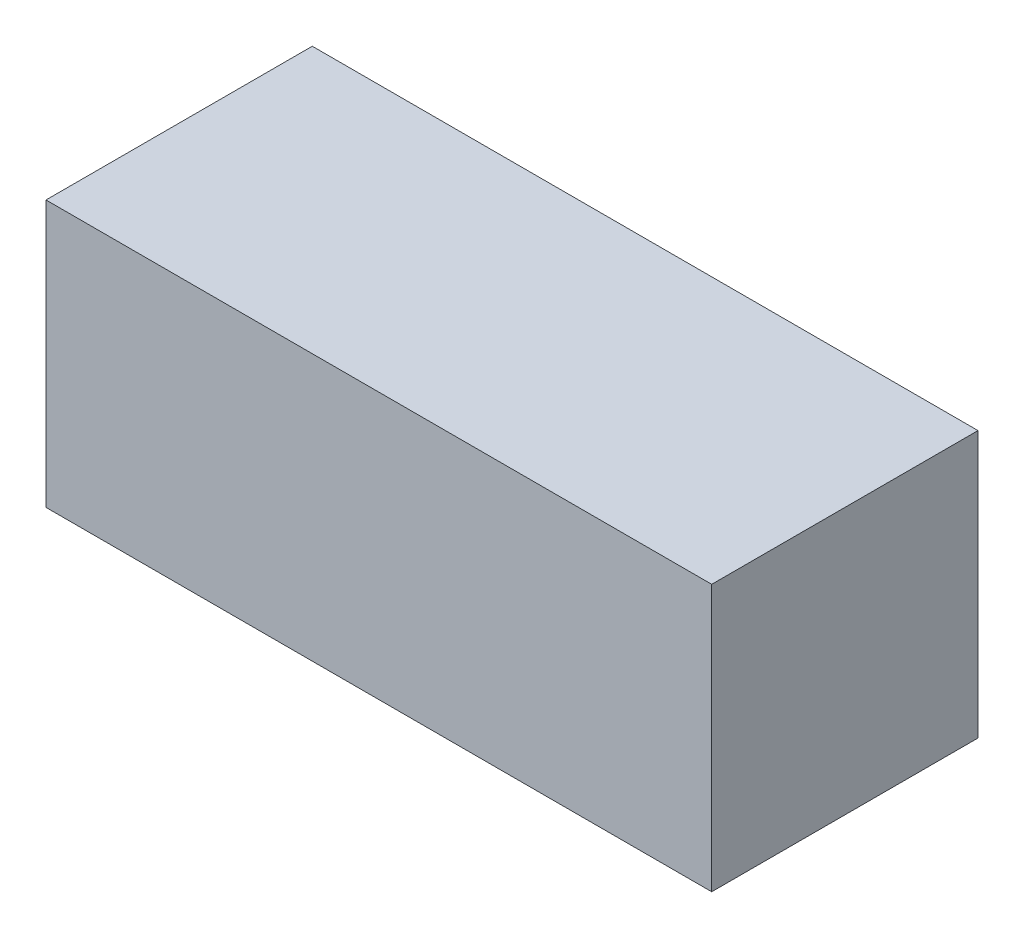
ISO-10303-21;
HEADER;
FILE_DESCRIPTION(('STEP AP214'),'2;1');
FILE_NAME('part.step','',(''),(''),'','','');
FILE_SCHEMA(('AUTOMOTIVE_DESIGN { 1 0 10303 214 1 1 1 1 }'));
ENDSEC;
DATA;
#1=APPLICATION_CONTEXT('core data for automotive mechanical design processes');
#2=APPLICATION_PROTOCOL_DEFINITION('international standard','automotive_design',2000,#1);
#3=PRODUCT_CONTEXT('',#1,'mechanical');
#4=PRODUCT('Part','Part','',(#3));
#5=PRODUCT_RELATED_PRODUCT_CATEGORY('part','',(#4));
#6=PRODUCT_DEFINITION_FORMATION('','',#4);
#7=PRODUCT_DEFINITION_CONTEXT('part definition',#1,'design');
#8=PRODUCT_DEFINITION('design','',#6,#7);
#9=PRODUCT_DEFINITION_SHAPE('','',#8);
#10=(LENGTH_UNIT() NAMED_UNIT(*) SI_UNIT(.MILLI.,.METRE.));
#11=(NAMED_UNIT(*) PLANE_ANGLE_UNIT() SI_UNIT($,.RADIAN.));
#12=(NAMED_UNIT(*) SI_UNIT($,.STERADIAN.) SOLID_ANGLE_UNIT());
#13=UNCERTAINTY_MEASURE_WITH_UNIT(LENGTH_MEASURE(1.E-05),#10,'distance_accuracy_value','');
#14=(GEOMETRIC_REPRESENTATION_CONTEXT(3) GLOBAL_UNCERTAINTY_ASSIGNED_CONTEXT((#13)) GLOBAL_UNIT_ASSIGNED_CONTEXT((#10,
#11,#12)) REPRESENTATION_CONTEXT('',''));
#15=CARTESIAN_POINT('',(0.,0.,0.));
#16=DIRECTION('',(0.,0.,1.));
#17=DIRECTION('',(1.,0.,0.));
#18=AXIS2_PLACEMENT_3D('',#15,#16,#17);
#19=CARTESIAN_POINT('',(503.178608832802,2000.,197.681641947689));
#20=DIRECTION('',(-1.,0.,0.));
#21=DIRECTION('',(0.,0.,1.));
#22=AXIS2_PLACEMENT_3D('',#19,#20,#21);
#23=PLANE('',#22);
#24=DIRECTION('',(0.,0.,-1.));
#25=VECTOR('',#24,1.);
#26=CARTESIAN_POINT('',(503.178608832802,0.,197.681641947689));
#27=LINE('',#26,#25);
#28=CARTESIAN_POINT('',(503.178608832802,0.,2197.68164194769));
#29=VERTEX_POINT('',#28);
#30=CARTESIAN_POINT('',(503.178608832802,0.,197.681641947689));
#31=VERTEX_POINT('',#30);
#32=EDGE_CURVE('E1816',#29,#31,#27,.T.);
#33=ORIENTED_EDGE('',*,*,#32,.T.);
#34=DIRECTION('',(0.,-1.,0.));
#35=VECTOR('',#34,1.);
#36=CARTESIAN_POINT('',(503.178608832802,2000.,197.681641947689));
#37=LINE('',#36,#35);
#38=CARTESIAN_POINT('',(503.178608832802,2000.,197.681641947689));
#39=VERTEX_POINT('',#38);
#40=EDGE_CURVE('E13',#39,#31,#37,.T.);
#41=ORIENTED_EDGE('',*,*,#40,.F.);
#42=DIRECTION('',(0.,0.,-1.));
#43=VECTOR('',#42,1.);
#44=CARTESIAN_POINT('',(503.178608832802,2000.,197.681641947689));
#45=LINE('',#44,#43);
#46=CARTESIAN_POINT('',(503.178608832802,2000.,2197.68164194769));
#47=VERTEX_POINT('',#46);
#48=EDGE_CURVE('E1804',#47,#39,#45,.T.);
#49=ORIENTED_EDGE('',*,*,#48,.F.);
#50=DIRECTION('',(0.,-1.,0.));
#51=VECTOR('',#50,1.);
#52=CARTESIAN_POINT('',(503.178608832802,2000.,2197.68164194769));
#53=LINE('',#52,#51);
#54=EDGE_CURVE('E1812',#47,#29,#53,.T.);
#55=ORIENTED_EDGE('',*,*,#54,.T.);
#56=EDGE_LOOP('',(#33,#41,#49,#55));
#57=FACE_BOUND('',#56,.T.);
#58=ADVANCED_FACE('F1753',(#57),#23,.F.);
#59=CARTESIAN_POINT('',(503.178608832802,2000.,197.681641947689));
#60=DIRECTION('',(0.,0.,1.));
#61=DIRECTION('',(1.,0.,0.));
#62=AXIS2_PLACEMENT_3D('',#59,#60,#61);
#63=PLANE('',#62);
#64=DIRECTION('',(-1.,0.,0.));
#65=VECTOR('',#64,1.);
#66=CARTESIAN_POINT('',(503.178608832802,0.,197.681641947689));
#67=LINE('',#66,#65);
#68=CARTESIAN_POINT('',(-4496.8213911672,0.,197.681641947689));
#69=VERTEX_POINT('',#68);
#70=EDGE_CURVE('E1808',#31,#69,#67,.T.);
#71=ORIENTED_EDGE('',*,*,#70,.T.);
#72=DIRECTION('',(0.,-1.,0.));
#73=VECTOR('',#72,1.);
#74=CARTESIAN_POINT('',(-4496.8213911672,2000.,197.681641947689));
#75=LINE('',#74,#73);
#76=CARTESIAN_POINT('',(-4496.8213911672,2000.,197.681641947689));
#77=VERTEX_POINT('',#76);
#78=EDGE_CURVE('E1761',#77,#69,#75,.T.);
#79=ORIENTED_EDGE('',*,*,#78,.F.);
#80=DIRECTION('',(-1.,0.,0.));
#81=VECTOR('',#80,1.);
#82=CARTESIAN_POINT('',(503.178608832802,2000.,197.681641947689));
#83=LINE('',#82,#81);
#84=EDGE_CURVE('E1799',#39,#77,#83,.T.);
#85=ORIENTED_EDGE('',*,*,#84,.F.);
#86=ORIENTED_EDGE('',*,*,#40,.T.);
#87=EDGE_LOOP('',(#71,#79,#85,#86));
#88=FACE_BOUND('',#87,.T.);
#89=ADVANCED_FACE('F1807',(#88),#63,.F.);
#90=CARTESIAN_POINT('',(-4496.8213911672,2000.,197.681641947689));
#91=DIRECTION('',(1.,0.,0.));
#92=DIRECTION('',(0.,0.,-1.));
#93=AXIS2_PLACEMENT_3D('',#90,#91,#92);
#94=PLANE('',#93);
#95=DIRECTION('',(0.,0.,1.));
#96=VECTOR('',#95,1.);
#97=CARTESIAN_POINT('',(-4496.8213911672,0.,197.681641947689));
#98=LINE('',#97,#96);
#99=CARTESIAN_POINT('',(-4496.8213911672,0.,2197.68164194769));
#100=VERTEX_POINT('',#99);
#101=EDGE_CURVE('E1786',#69,#100,#98,.T.);
#102=ORIENTED_EDGE('',*,*,#101,.T.);
#103=DIRECTION('',(0.,-1.,0.));
#104=VECTOR('',#103,1.);
#105=CARTESIAN_POINT('',(-4496.8213911672,2000.,2197.68164194769));
#106=LINE('',#105,#104);
#107=CARTESIAN_POINT('',(-4496.8213911672,2000.,2197.68164194769));
#108=VERTEX_POINT('',#107);
#109=EDGE_CURVE('E1809',#108,#100,#106,.T.);
#110=ORIENTED_EDGE('',*,*,#109,.F.);
#111=DIRECTION('',(0.,0.,1.));
#112=VECTOR('',#111,1.);
#113=CARTESIAN_POINT('',(-4496.8213911672,2000.,197.681641947689));
#114=LINE('',#113,#112);
#115=EDGE_CURVE('E1802',#77,#108,#114,.T.);
#116=ORIENTED_EDGE('',*,*,#115,.F.);
#117=ORIENTED_EDGE('',*,*,#78,.T.);
#118=EDGE_LOOP('',(#102,#110,#116,#117));
#119=FACE_BOUND('',#118,.T.);
#120=ADVANCED_FACE('F1810',(#119),#94,.F.);
#121=CARTESIAN_POINT('',(503.178608832802,2000.,2197.68164194769));
#122=DIRECTION('',(0.,0.,-1.));
#123=DIRECTION('',(-1.,0.,0.));
#124=AXIS2_PLACEMENT_3D('',#121,#122,#123);
#125=PLANE('',#124);
#126=DIRECTION('',(1.,0.,0.));
#127=VECTOR('',#126,1.);
#128=CARTESIAN_POINT('',(503.178608832802,0.,2197.68164194769));
#129=LINE('',#128,#127);
#130=EDGE_CURVE('E1792',#100,#29,#129,.T.);
#131=ORIENTED_EDGE('',*,*,#130,.T.);
#132=ORIENTED_EDGE('',*,*,#54,.F.);
#133=DIRECTION('',(1.,0.,0.));
#134=VECTOR('',#133,1.);
#135=CARTESIAN_POINT('',(503.178608832802,2000.,2197.68164194769));
#136=LINE('',#135,#134);
#137=EDGE_CURVE('E1769',#108,#47,#136,.T.);
#138=ORIENTED_EDGE('',*,*,#137,.F.);
#139=ORIENTED_EDGE('',*,*,#109,.T.);
#140=EDGE_LOOP('',(#131,#132,#138,#139));
#141=FACE_BOUND('',#140,.T.);
#142=ADVANCED_FACE('F1823',(#141),#125,.F.);
#143=CARTESIAN_POINT('',(0.,2000.,0.));
#144=DIRECTION('',(0.,-1.,0.));
#145=DIRECTION('',(0.,0.,-1.));
#146=AXIS2_PLACEMENT_3D('',#143,#144,#145);
#147=PLANE('',#146);
#148=ORIENTED_EDGE('',*,*,#48,.T.);
#149=ORIENTED_EDGE('',*,*,#84,.T.);
#150=ORIENTED_EDGE('',*,*,#115,.T.);
#151=ORIENTED_EDGE('',*,*,#137,.T.);
#152=EDGE_LOOP('',(#148,#149,#150,#151));
#153=FACE_BOUND('',#152,.T.);
#154=ADVANCED_FACE('F1800',(#153),#147,.F.);
#155=CARTESIAN_POINT('',(0.,0.,0.));
#156=DIRECTION('',(0.,-1.,0.));
#157=DIRECTION('',(0.,0.,-1.));
#158=AXIS2_PLACEMENT_3D('',#155,#156,#157);
#159=PLANE('',#158);
#160=ORIENTED_EDGE('',*,*,#32,.F.);
#161=ORIENTED_EDGE('',*,*,#130,.F.);
#162=ORIENTED_EDGE('',*,*,#101,.F.);
#163=ORIENTED_EDGE('',*,*,#70,.F.);
#164=EDGE_LOOP('',(#160,#161,#162,#163));
#165=FACE_BOUND('',#164,.T.);
#166=ADVANCED_FACE('F1826',(#165),#159,.T.);
#167=CLOSED_SHELL('',(#58,#89,#120,#142,#154,#166));
#168=MANIFOLD_SOLID_BREP('B2_NOT_SHOWN',#167);
#169=CARTESIAN_POINT('',(-258.447090393941,705.,341.76577979491));
#170=DIRECTION('',(0.,1.,0.));
#171=DIRECTION('',(0.,0.,1.));
#172=AXIS2_PLACEMENT_3D('',#169,#170,#171);
#173=PLANE('',#172);
#174=CARTESIAN_POINT('',(-474.449169572246,705.,382.793687092254));
#175=DIRECTION('',(0.,1.,0.));
#176=DIRECTION('',(0.,0.,1.));
#177=AXIS2_PLACEMENT_3D('',#174,#175,#176);
#178=CIRCLE('',#177,3.02232510648865);
#179=CARTESIAN_POINT('',(-474.449169572246,705.,385.816012198742));
#180=VERTEX_POINT('',#179);
#181=EDGE_CURVE('E2245',#180,#180,#178,.T.);
#182=ORIENTED_EDGE('',*,*,#181,.F.);
#183=EDGE_LOOP('',(#182));
#184=FACE_BOUND('',#183,.T.);
#185=CARTESIAN_POINT('',(-466.317801150332,705.,375.92365410933));
#186=DIRECTION('',(0.,1.,0.));
#187=DIRECTION('',(0.,0.,1.));
#188=AXIS2_PLACEMENT_3D('',#185,#186,#187);
#189=CIRCLE('',#188,2.92635446588858);
#190=CARTESIAN_POINT('',(-466.317801150332,705.,378.850008575219));
#191=VERTEX_POINT('',#190);
#192=EDGE_CURVE('E2574',#191,#191,#189,.T.);
#193=ORIENTED_EDGE('',*,*,#192,.F.);
#194=EDGE_LOOP('',(#193));
#195=FACE_BOUND('',#194,.T.);
#196=CARTESIAN_POINT('',(-431.013382426237,705.,332.77130718692));
#197=DIRECTION('',(0.,1.,0.));
#198=DIRECTION('',(0.,0.,1.));
#199=AXIS2_PLACEMENT_3D('',#196,#197,#198);
#200=CIRCLE('',#199,2.96969460121312);
#201=CARTESIAN_POINT('',(-431.013382426237,705.,335.741001788134));
#202=VERTEX_POINT('',#201);
#203=EDGE_CURVE('E2577',#202,#202,#200,.T.);
#204=ORIENTED_EDGE('',*,*,#203,.F.);
#205=EDGE_LOOP('',(#204));
#206=FACE_BOUND('',#205,.T.);
#207=CARTESIAN_POINT('',(-421.082774625095,705.,327.80979347949));
#208=DIRECTION('',(0.,1.,0.));
#209=DIRECTION('',(0.,0.,1.));
#210=AXIS2_PLACEMENT_3D('',#207,#208,#209);
#211=CIRCLE('',#210,3.01217780293913);
#212=CARTESIAN_POINT('',(-421.082774625095,705.,330.821971282429));
#213=VERTEX_POINT('',#212);
#214=EDGE_CURVE('E2582',#213,#213,#211,.T.);
#215=ORIENTED_EDGE('',*,*,#214,.F.);
#216=EDGE_LOOP('',(#215));
#217=FACE_BOUND('',#216,.T.);
#218=CARTESIAN_POINT('',(-364.017672886245,705.,296.048587357132));
#219=DIRECTION('',(0.,1.,0.));
#220=DIRECTION('',(0.,0.,1.));
#221=AXIS2_PLACEMENT_3D('',#218,#219,#220);
#222=CIRCLE('',#221,3.02057651298697);
#223=CARTESIAN_POINT('',(-364.017672886245,705.,299.069163870119));
#224=VERTEX_POINT('',#223);
#225=EDGE_CURVE('E2585',#224,#224,#222,.T.);
#226=ORIENTED_EDGE('',*,*,#225,.F.);
#227=EDGE_LOOP('',(#226));
#228=FACE_BOUND('',#227,.T.);
#229=CARTESIAN_POINT('',(-346.372819063942,705.,293.429327819401));
#230=DIRECTION('',(0.,1.,0.));
#231=DIRECTION('',(0.,0.,1.));
#232=AXIS2_PLACEMENT_3D('',#229,#230,#231);
#233=CIRCLE('',#232,2.94464183129883);
#234=CARTESIAN_POINT('',(-346.372819063942,705.,296.3739696507));
#235=VERTEX_POINT('',#234);
#236=EDGE_CURVE('E2588',#235,#235,#233,.T.);
#237=ORIENTED_EDGE('',*,*,#236,.F.);
#238=EDGE_LOOP('',(#237));
#239=FACE_BOUND('',#238,.T.);
#240=CARTESIAN_POINT('',(-223.024834580686,705.,263.802212935845));
#241=DIRECTION('',(0.,1.,0.));
#242=DIRECTION('',(0.,0.,1.));
#243=AXIS2_PLACEMENT_3D('',#240,#241,#242);
#244=CIRCLE('',#243,3.99999999999999);
#245=CARTESIAN_POINT('',(-223.024834580686,705.,267.802212935845));
#246=VERTEX_POINT('',#245);
#247=EDGE_CURVE('E2591',#246,#246,#244,.T.);
#248=ORIENTED_EDGE('',*,*,#247,.F.);
#249=EDGE_LOOP('',(#248));
#250=FACE_BOUND('',#249,.T.);
#251=CARTESIAN_POINT('',(-154.344703344319,705.,260.643821632466));
#252=DIRECTION('',(0.,1.,0.));
#253=DIRECTION('',(0.,0.,1.));
#254=AXIS2_PLACEMENT_3D('',#251,#252,#253);
#255=CIRCLE('',#254,3.99999999999999);
#256=CARTESIAN_POINT('',(-154.344703344319,705.,264.643821632466));
#257=VERTEX_POINT('',#256);
#258=EDGE_CURVE('E2593',#257,#257,#255,.T.);
#259=ORIENTED_EDGE('',*,*,#258,.F.);
#260=EDGE_LOOP('',(#259));
#261=FACE_BOUND('',#260,.T.);
#262=CARTESIAN_POINT('',(-94.9095215443751,705.,263.802212935845));
#263=DIRECTION('',(0.,1.,0.));
#264=DIRECTION('',(0.,0.,1.));
#265=AXIS2_PLACEMENT_3D('',#262,#263,#264);
#266=CIRCLE('',#265,4.00000000000001);
#267=CARTESIAN_POINT('',(-94.9095215443751,705.,267.802212935845));
#268=VERTEX_POINT('',#267);
#269=EDGE_CURVE('E2048',#268,#268,#266,.T.);
#270=ORIENTED_EDGE('',*,*,#269,.F.);
#271=EDGE_LOOP('',(#270));
#272=FACE_BOUND('',#271,.T.);
#273=CARTESIAN_POINT('',(-66.2029870226294,705.,312.681641947689));
#274=CARTESIAN_POINT('',(-268.546265084858,705.,303.965113500045));
#275=CARTESIAN_POINT('',(-436.202987022629,705.,427.681641947689));
#276=B_SPLINE_CURVE_WITH_KNOTS('',2,(#273,#274,#275),.UNSPECIFIED.,.F.,.F.,(3,3),(0.,1.),.UNSPECIFIED.);
#277=CARTESIAN_POINT('',(-66.2029870226294,705.,312.681641947689));
#278=VERTEX_POINT('',#277);
#279=CARTESIAN_POINT('',(-436.202987022629,705.,427.681641947689));
#280=VERTEX_POINT('',#279);
#281=EDGE_CURVE('E1901',#278,#280,#276,.T.);
#282=ORIENTED_EDGE('',*,*,#281,.F.);
#283=DIRECTION('',(0.,0.,-1.));
#284=VECTOR('',#283,1.);
#285=CARTESIAN_POINT('',(-66.2029870226294,705.,317.681641947689));
#286=LINE('',#285,#284);
#287=CARTESIAN_POINT('',(-66.2029870226294,705.,317.681641947689));
#288=VERTEX_POINT('',#287);
#289=EDGE_CURVE('E2216',#288,#278,#286,.T.);
#290=ORIENTED_EDGE('',*,*,#289,.F.);
#291=CARTESIAN_POINT('',(-66.2029870226294,705.,277.681641947689));
#292=DIRECTION('',(0.,1.,0.));
#293=DIRECTION('',(0.,0.,1.));
#294=AXIS2_PLACEMENT_3D('',#291,#292,#293);
#295=CIRCLE('',#294,40.);
#296=CARTESIAN_POINT('',(-26.2029870226294,705.,277.681641947689));
#297=VERTEX_POINT('',#296);
#298=EDGE_CURVE('E2167',#288,#297,#295,.T.);
#299=ORIENTED_EDGE('',*,*,#298,.T.);
#300=DIRECTION('',(0.,0.,-1.));
#301=VECTOR('',#300,1.);
#302=CARTESIAN_POINT('',(-26.2029870226295,705.,237.681641947689));
#303=LINE('',#302,#301);
#304=CARTESIAN_POINT('',(-26.2029870226295,705.,242.681641947689));
#305=VERTEX_POINT('',#304);
#306=EDGE_CURVE('E2160',#297,#305,#303,.T.);
#307=ORIENTED_EDGE('',*,*,#306,.T.);
#308=DIRECTION('',(1.,0.,0.));
#309=VECTOR('',#308,1.);
#310=CARTESIAN_POINT('',(-563.923005749217,705.,242.681641947689));
#311=LINE('',#310,#309);
#312=CARTESIAN_POINT('',(-516.202987022629,705.,242.681641947689));
#313=VERTEX_POINT('',#312);
#314=EDGE_CURVE('E2290',#313,#305,#311,.T.);
#315=ORIENTED_EDGE('',*,*,#314,.F.);
#316=DIRECTION('',(0.,0.,1.));
#317=VECTOR('',#316,1.);
#318=CARTESIAN_POINT('',(-516.202987022629,705.,341.76577979491));
#319=LINE('',#318,#317);
#320=CARTESIAN_POINT('',(-516.202987022629,705.,432.681641947689));
#321=VERTEX_POINT('',#320);
#322=EDGE_CURVE('E2267',#313,#321,#319,.T.);
#323=ORIENTED_EDGE('',*,*,#322,.T.);
#324=DIRECTION('',(1.,0.,0.));
#325=VECTOR('',#324,1.);
#326=CARTESIAN_POINT('',(-521.202987022629,705.,432.681641947689));
#327=LINE('',#326,#325);
#328=CARTESIAN_POINT('',(-436.202987022629,705.,432.681641947689));
#329=VERTEX_POINT('',#328);
#330=EDGE_CURVE('E2184',#321,#329,#327,.T.);
#331=ORIENTED_EDGE('',*,*,#330,.T.);
#332=DIRECTION('',(0.,0.,1.));
#333=VECTOR('',#332,1.);
#334=CARTESIAN_POINT('',(-436.202987022629,705.,432.681641947689));
#335=LINE('',#334,#333);
#336=EDGE_CURVE('E1906',#280,#329,#335,.T.);
#337=ORIENTED_EDGE('',*,*,#336,.F.);
#338=EDGE_LOOP('',(#282,#290,#299,#307,#315,#323,#331,#337));
#339=FACE_BOUND('',#338,.T.);
#340=ADVANCED_FACE('F1884',(#184,#195,#206,#217,#228,#239,#250,#261,#272,#339),#173,.T.);
#341=CARTESIAN_POINT('',(-563.923005749217,0.,242.681641947689));
#342=DIRECTION('',(0.,0.,-1.));
#343=DIRECTION('',(-1.,0.,0.));
#344=AXIS2_PLACEMENT_3D('',#341,#342,#343);
#345=PLANE('',#344);
#346=DIRECTION('',(0.,1.,0.));
#347=VECTOR('',#346,1.);
#348=CARTESIAN_POINT('',(-516.202987022629,0.,242.681641947689));
#349=LINE('',#348,#347);
#350=CARTESIAN_POINT('',(-516.202987022629,715.857864376269,242.681641947689));
#351=VERTEX_POINT('',#350);
#352=EDGE_CURVE('E2265',#313,#351,#349,.T.);
#353=ORIENTED_EDGE('',*,*,#352,.F.);
#354=ORIENTED_EDGE('',*,*,#314,.T.);
#355=DIRECTION('',(0.,1.,0.));
#356=VECTOR('',#355,1.);
#357=CARTESIAN_POINT('',(-26.2029870226295,0.,242.681641947689));
#358=LINE('',#357,#356);
#359=CARTESIAN_POINT('',(-26.2029870226295,715.857864376269,242.681641947689));
#360=VERTEX_POINT('',#359);
#361=EDGE_CURVE('E2285',#305,#360,#358,.T.);
#362=ORIENTED_EDGE('',*,*,#361,.T.);
#363=DIRECTION('',(1.,0.,0.));
#364=VECTOR('',#363,1.);
#365=CARTESIAN_POINT('',(-563.923005749217,715.857864376269,242.681641947689));
#366=LINE('',#365,#364);
#367=EDGE_CURVE('E2292',#351,#360,#366,.T.);
#368=ORIENTED_EDGE('',*,*,#367,.F.);
#369=EDGE_LOOP('',(#353,#354,#362,#368));
#370=FACE_BOUND('',#369,.T.);
#371=ADVANCED_FACE('F2112',(#370),#345,.F.);
#372=CARTESIAN_POINT('',(-563.923005749217,730.,237.681641947689));
#373=DIRECTION('',(1.,0.,0.));
#374=DIRECTION('',(0.,0.,-1.));
#375=AXIS2_PLACEMENT_3D('',#372,#373,#374);
#376=CYLINDRICAL_SURFACE('',#375,15.);
#377=DIRECTION('',(1.,0.,0.));
#378=VECTOR('',#377,1.);
#379=CARTESIAN_POINT('',(-563.923005749217,745.,237.681641947689));
#380=LINE('',#379,#378);
#381=CARTESIAN_POINT('',(-516.202987022629,745.,237.681641947689));
#382=VERTEX_POINT('',#381);
#383=CARTESIAN_POINT('',(-26.2029870226295,745.,237.681641947689));
#384=VERTEX_POINT('',#383);
#385=EDGE_CURVE('E2296',#382,#384,#380,.T.);
#386=ORIENTED_EDGE('',*,*,#385,.F.);
#387=CARTESIAN_POINT('',(-516.202987022629,730.,237.681641947689));
#388=DIRECTION('',(-1.,0.,0.));
#389=DIRECTION('',(0.,0.,1.));
#390=AXIS2_PLACEMENT_3D('',#387,#388,#389);
#391=CIRCLE('',#390,15.);
#392=EDGE_CURVE('E2262',#382,#351,#391,.F.);
#393=ORIENTED_EDGE('',*,*,#392,.T.);
#394=ORIENTED_EDGE('',*,*,#367,.T.);
#395=CARTESIAN_POINT('',(-26.2029870226295,730.,237.681641947689));
#396=DIRECTION('',(1.,0.,0.));
#397=DIRECTION('',(0.,0.,-1.));
#398=AXIS2_PLACEMENT_3D('',#395,#396,#397);
#399=CIRCLE('',#398,15.);
#400=EDGE_CURVE('E2282',#384,#360,#399,.T.);
#401=ORIENTED_EDGE('',*,*,#400,.F.);
#402=EDGE_LOOP('',(#386,#393,#394,#401));
#403=FACE_BOUND('',#402,.T.);
#404=ADVANCED_FACE('F2120',(#403),#376,.T.);
#405=CARTESIAN_POINT('',(-26.2029870226295,705.,237.681641947689));
#406=DIRECTION('',(0.,0.,1.));
#407=DIRECTION('',(1.,0.,0.));
#408=AXIS2_PLACEMENT_3D('',#405,#406,#407);
#409=PLANE('',#408);
#410=DIRECTION('',(1.,0.,0.));
#411=VECTOR('',#410,1.);
#412=CARTESIAN_POINT('',(-563.923005749217,717.5,237.681641947689));
#413=LINE('',#412,#411);
#414=CARTESIAN_POINT('',(-521.202987022629,717.5,237.681641947689));
#415=VERTEX_POINT('',#414);
#416=CARTESIAN_POINT('',(-26.2029870226295,717.5,237.681641947689));
#417=VERTEX_POINT('',#416);
#418=EDGE_CURVE('E2276',#415,#417,#413,.T.);
#419=ORIENTED_EDGE('',*,*,#418,.T.);
#420=DIRECTION('',(0.,-1.,0.));
#421=VECTOR('',#420,1.);
#422=CARTESIAN_POINT('',(-26.2029870226295,705.,237.681641947689));
#423=LINE('',#422,#421);
#424=CARTESIAN_POINT('',(-26.2029870226295,700.,237.681641947689));
#425=VERTEX_POINT('',#424);
#426=EDGE_CURVE('E2189',#417,#425,#423,.T.);
#427=ORIENTED_EDGE('',*,*,#426,.T.);
#428=DIRECTION('',(-1.,0.,0.));
#429=VECTOR('',#428,1.);
#430=CARTESIAN_POINT('',(-26.2029870226295,700.,237.681641947689));
#431=LINE('',#430,#429);
#432=CARTESIAN_POINT('',(-521.202987022629,700.,237.681641947689));
#433=VERTEX_POINT('',#432);
#434=EDGE_CURVE('E2270',#425,#433,#431,.T.);
#435=ORIENTED_EDGE('',*,*,#434,.T.);
#436=DIRECTION('',(0.,-1.,0.));
#437=VECTOR('',#436,1.);
#438=CARTESIAN_POINT('',(-521.202987022629,705.,237.681641947689));
#439=LINE('',#438,#437);
#440=EDGE_CURVE('E2186',#415,#433,#439,.T.);
#441=ORIENTED_EDGE('',*,*,#440,.F.);
#442=EDGE_LOOP('',(#419,#427,#435,#441));
#443=FACE_BOUND('',#442,.T.);
#444=ADVANCED_FACE('F2138',(#443),#409,.F.);
#445=CARTESIAN_POINT('',(-521.202987022629,705.,432.681641947689));
#446=DIRECTION('',(0.,0.,-1.));
#447=DIRECTION('',(-1.,0.,0.));
#448=AXIS2_PLACEMENT_3D('',#445,#446,#447);
#449=PLANE('',#448);
#450=DIRECTION('',(1.,0.,0.));
#451=VECTOR('',#450,1.);
#452=CARTESIAN_POINT('',(-521.202987022629,700.,432.681641947689));
#453=LINE('',#452,#451);
#454=CARTESIAN_POINT('',(-521.202987022629,700.,432.681641947689));
#455=VERTEX_POINT('',#454);
#456=CARTESIAN_POINT('',(-436.202987022629,700.,432.681641947689));
#457=VERTEX_POINT('',#456);
#458=EDGE_CURVE('E2168',#455,#457,#453,.T.);
#459=ORIENTED_EDGE('',*,*,#458,.T.);
#460=DIRECTION('',(0.,-1.,0.));
#461=VECTOR('',#460,1.);
#462=CARTESIAN_POINT('',(-436.202987022629,705.,432.681641947689));
#463=LINE('',#462,#461);
#464=EDGE_CURVE('E1751',#329,#457,#463,.T.);
#465=ORIENTED_EDGE('',*,*,#464,.F.);
#466=ORIENTED_EDGE('',*,*,#330,.F.);
#467=DIRECTION('',(0.,1.,0.));
#468=VECTOR('',#467,1.);
#469=CARTESIAN_POINT('',(-516.202987022629,745.,432.681641947689));
#470=LINE('',#469,#468);
#471=CARTESIAN_POINT('',(-516.202987022629,745.,432.681641947689));
#472=VERTEX_POINT('',#471);
#473=EDGE_CURVE('E2017',#321,#472,#470,.T.);
#474=ORIENTED_EDGE('',*,*,#473,.T.);
#475=DIRECTION('',(-1.,0.,0.));
#476=VECTOR('',#475,1.);
#477=CARTESIAN_POINT('',(-516.202987022629,745.,432.681641947689));
#478=LINE('',#477,#476);
#479=CARTESIAN_POINT('',(-521.202987022629,745.,432.681641947689));
#480=VERTEX_POINT('',#479);
#481=EDGE_CURVE('E2258',#472,#480,#478,.T.);
#482=ORIENTED_EDGE('',*,*,#481,.T.);
#483=DIRECTION('',(0.,-1.,0.));
#484=VECTOR('',#483,1.);
#485=CARTESIAN_POINT('',(-521.202987022629,705.,432.681641947689));
#486=LINE('',#485,#484);
#487=EDGE_CURVE('E2166',#480,#455,#486,.T.);
#488=ORIENTED_EDGE('',*,*,#487,.T.);
#489=EDGE_LOOP('',(#459,#465,#466,#474,#482,#488));
#490=FACE_BOUND('',#489,.T.);
#491=ADVANCED_FACE('F1886',(#490),#449,.F.);
#492=CARTESIAN_POINT('',(-26.2029870226295,705.,237.681641947689));
#493=DIRECTION('',(-1.,0.,0.));
#494=DIRECTION('',(0.,0.,1.));
#495=AXIS2_PLACEMENT_3D('',#492,#493,#494);
#496=PLANE('',#495);
#497=DIRECTION('',(0.,0.,-1.));
#498=VECTOR('',#497,1.);
#499=CARTESIAN_POINT('',(-26.2029870226295,700.,237.681641947689));
#500=LINE('',#499,#498);
#501=CARTESIAN_POINT('',(-26.2029870226294,700.,277.681641947689));
#502=VERTEX_POINT('',#501);
#503=EDGE_CURVE('E2179',#502,#425,#500,.T.);
#504=ORIENTED_EDGE('',*,*,#503,.T.);
#505=ORIENTED_EDGE('',*,*,#426,.F.);
#506=CARTESIAN_POINT('',(-26.2029870226295,730.,237.681641947689));
#507=DIRECTION('',(1.,0.,0.));
#508=DIRECTION('',(0.,0.,-1.));
#509=AXIS2_PLACEMENT_3D('',#506,#507,#508);
#510=CIRCLE('',#509,12.5);
#511=CARTESIAN_POINT('',(-26.2029870226295,742.5,237.681641947689));
#512=VERTEX_POINT('',#511);
#513=EDGE_CURVE('E2272',#512,#417,#510,.T.);
#514=ORIENTED_EDGE('',*,*,#513,.F.);
#515=DIRECTION('',(0.,1.,0.));
#516=VECTOR('',#515,1.);
#517=CARTESIAN_POINT('',(-26.2029870226295,0.,237.681641947689));
#518=LINE('',#517,#516);
#519=EDGE_CURVE('E2279',#512,#384,#518,.T.);
#520=ORIENTED_EDGE('',*,*,#519,.T.);
#521=ORIENTED_EDGE('',*,*,#400,.T.);
#522=ORIENTED_EDGE('',*,*,#361,.F.);
#523=ORIENTED_EDGE('',*,*,#306,.F.);
#524=DIRECTION('',(0.,-1.,0.));
#525=VECTOR('',#524,1.);
#526=CARTESIAN_POINT('',(-26.2029870226294,705.,277.681641947689));
#527=LINE('',#526,#525);
#528=EDGE_CURVE('E2192',#297,#502,#527,.T.);
#529=ORIENTED_EDGE('',*,*,#528,.T.);
#530=EDGE_LOOP('',(#504,#505,#514,#520,#521,#522,#523,#529));
#531=FACE_BOUND('',#530,.T.);
#532=ADVANCED_FACE('F2136',(#531),#496,.F.);
#533=CARTESIAN_POINT('',(-521.202987022629,705.,237.681641947689));
#534=DIRECTION('',(1.,0.,0.));
#535=DIRECTION('',(0.,0.,-1.));
#536=AXIS2_PLACEMENT_3D('',#533,#534,#535);
#537=PLANE('',#536);
#538=ORIENTED_EDGE('',*,*,#487,.F.);
#539=DIRECTION('',(0.,0.,-1.));
#540=VECTOR('',#539,1.);
#541=CARTESIAN_POINT('',(-521.202987022629,745.,237.681641947689));
#542=LINE('',#541,#540);
#543=CARTESIAN_POINT('',(-521.202987022629,745.,237.681641947689));
#544=VERTEX_POINT('',#543);
#545=EDGE_CURVE('E2014',#480,#544,#542,.T.);
#546=ORIENTED_EDGE('',*,*,#545,.T.);
#547=DIRECTION('',(0.,-1.,0.));
#548=VECTOR('',#547,1.);
#549=CARTESIAN_POINT('',(-521.202987022629,0.,237.681641947689));
#550=LINE('',#549,#548);
#551=CARTESIAN_POINT('',(-521.202987022629,742.5,237.681641947689));
#552=VERTEX_POINT('',#551);
#553=EDGE_CURVE('E2158',#544,#552,#550,.T.);
#554=ORIENTED_EDGE('',*,*,#553,.T.);
#555=CARTESIAN_POINT('',(-521.202987022629,730.,237.681641947689));
#556=DIRECTION('',(1.,0.,0.));
#557=DIRECTION('',(0.,0.,-1.));
#558=AXIS2_PLACEMENT_3D('',#555,#556,#557);
#559=CIRCLE('',#558,12.5);
#560=EDGE_CURVE('E2273',#415,#552,#559,.F.);
#561=ORIENTED_EDGE('',*,*,#560,.F.);
#562=ORIENTED_EDGE('',*,*,#440,.T.);
#563=DIRECTION('',(0.,0.,1.));
#564=VECTOR('',#563,1.);
#565=CARTESIAN_POINT('',(-521.202987022629,700.,237.681641947689));
#566=LINE('',#565,#564);
#567=EDGE_CURVE('E2181',#433,#455,#566,.T.);
#568=ORIENTED_EDGE('',*,*,#567,.T.);
#569=EDGE_LOOP('',(#538,#546,#554,#561,#562,#568));
#570=FACE_BOUND('',#569,.T.);
#571=ADVANCED_FACE('F2132',(#570),#537,.F.);
#572=CARTESIAN_POINT('',(-258.447090393941,700.,341.76577979491));
#573=DIRECTION('',(0.,1.,0.));
#574=DIRECTION('',(0.,0.,1.));
#575=AXIS2_PLACEMENT_3D('',#572,#573,#574);
#576=PLANE('',#575);
#577=CARTESIAN_POINT('',(-474.449169572246,700.,382.793687092254));
#578=DIRECTION('',(0.,1.,0.));
#579=DIRECTION('',(0.,0.,1.));
#580=AXIS2_PLACEMENT_3D('',#577,#578,#579);
#581=CIRCLE('',#580,3.02232510648865);
#582=CARTESIAN_POINT('',(-474.449169572246,700.,385.816012198742));
#583=VERTEX_POINT('',#582);
#584=EDGE_CURVE('E1888',#583,#583,#581,.T.);
#585=ORIENTED_EDGE('',*,*,#584,.T.);
#586=EDGE_LOOP('',(#585));
#587=FACE_BOUND('',#586,.T.);
#588=CARTESIAN_POINT('',(-466.317801150332,700.,375.92365410933));
#589=DIRECTION('',(0.,1.,0.));
#590=DIRECTION('',(0.,0.,1.));
#591=AXIS2_PLACEMENT_3D('',#588,#589,#590);
#592=CIRCLE('',#591,2.92635446588858);
#593=CARTESIAN_POINT('',(-466.317801150332,700.,378.850008575219));
#594=VERTEX_POINT('',#593);
#595=EDGE_CURVE('E2218',#594,#594,#592,.T.);
#596=ORIENTED_EDGE('',*,*,#595,.T.);
#597=EDGE_LOOP('',(#596));
#598=FACE_BOUND('',#597,.T.);
#599=CARTESIAN_POINT('',(-431.013382426237,700.,332.77130718692));
#600=DIRECTION('',(0.,1.,0.));
#601=DIRECTION('',(0.,0.,1.));
#602=AXIS2_PLACEMENT_3D('',#599,#600,#601);
#603=CIRCLE('',#602,2.96969460121312);
#604=CARTESIAN_POINT('',(-431.013382426237,700.,335.741001788134));
#605=VERTEX_POINT('',#604);
#606=EDGE_CURVE('E2221',#605,#605,#603,.T.);
#607=ORIENTED_EDGE('',*,*,#606,.T.);
#608=EDGE_LOOP('',(#607));
#609=FACE_BOUND('',#608,.T.);
#610=CARTESIAN_POINT('',(-421.082774625095,700.,327.80979347949));
#611=DIRECTION('',(0.,1.,0.));
#612=DIRECTION('',(0.,0.,1.));
#613=AXIS2_PLACEMENT_3D('',#610,#611,#612);
#614=CIRCLE('',#613,3.01217780293913);
#615=CARTESIAN_POINT('',(-421.082774625095,700.,330.821971282429));
#616=VERTEX_POINT('',#615);
#617=EDGE_CURVE('E2225',#616,#616,#614,.T.);
#618=ORIENTED_EDGE('',*,*,#617,.T.);
#619=EDGE_LOOP('',(#618));
#620=FACE_BOUND('',#619,.T.);
#621=CARTESIAN_POINT('',(-364.017672886245,700.,296.048587357132));
#622=DIRECTION('',(0.,1.,0.));
#623=DIRECTION('',(0.,0.,1.));
#624=AXIS2_PLACEMENT_3D('',#621,#622,#623);
#625=CIRCLE('',#624,3.02057651298697);
#626=CARTESIAN_POINT('',(-364.017672886245,700.,299.069163870119));
#627=VERTEX_POINT('',#626);
#628=EDGE_CURVE('E2230',#627,#627,#625,.T.);
#629=ORIENTED_EDGE('',*,*,#628,.T.);
#630=EDGE_LOOP('',(#629));
#631=FACE_BOUND('',#630,.T.);
#632=CARTESIAN_POINT('',(-346.372819063942,700.,293.429327819401));
#633=DIRECTION('',(0.,1.,0.));
#634=DIRECTION('',(0.,0.,1.));
#635=AXIS2_PLACEMENT_3D('',#632,#633,#634);
#636=CIRCLE('',#635,2.94464183129883);
#637=CARTESIAN_POINT('',(-346.372819063942,700.,296.3739696507));
#638=VERTEX_POINT('',#637);
#639=EDGE_CURVE('E2233',#638,#638,#636,.T.);
#640=ORIENTED_EDGE('',*,*,#639,.T.);
#641=EDGE_LOOP('',(#640));
#642=FACE_BOUND('',#641,.T.);
#643=CARTESIAN_POINT('',(-223.024834580686,700.,263.802212935845));
#644=DIRECTION('',(0.,1.,0.));
#645=DIRECTION('',(0.,0.,1.));
#646=AXIS2_PLACEMENT_3D('',#643,#644,#645);
#647=CIRCLE('',#646,3.99999999999999);
#648=CARTESIAN_POINT('',(-223.024834580686,700.,267.802212935845));
#649=VERTEX_POINT('',#648);
#650=EDGE_CURVE('E2236',#649,#649,#647,.T.);
#651=ORIENTED_EDGE('',*,*,#650,.T.);
#652=EDGE_LOOP('',(#651));
#653=FACE_BOUND('',#652,.T.);
#654=CARTESIAN_POINT('',(-154.344703344319,700.,260.643821632466));
#655=DIRECTION('',(0.,1.,0.));
#656=DIRECTION('',(0.,0.,1.));
#657=AXIS2_PLACEMENT_3D('',#654,#655,#656);
#658=CIRCLE('',#657,3.99999999999999);
#659=CARTESIAN_POINT('',(-154.344703344319,700.,264.643821632466));
#660=VERTEX_POINT('',#659);
#661=EDGE_CURVE('E2239',#660,#660,#658,.T.);
#662=ORIENTED_EDGE('',*,*,#661,.T.);
#663=EDGE_LOOP('',(#662));
#664=FACE_BOUND('',#663,.T.);
#665=CARTESIAN_POINT('',(-94.9095215443751,700.,263.802212935845));
#666=DIRECTION('',(0.,1.,0.));
#667=DIRECTION('',(0.,0.,1.));
#668=AXIS2_PLACEMENT_3D('',#665,#666,#667);
#669=CIRCLE('',#668,4.00000000000001);
#670=CARTESIAN_POINT('',(-94.9095215443751,700.,267.802212935845));
#671=VERTEX_POINT('',#670);
#672=EDGE_CURVE('E2242',#671,#671,#669,.T.);
#673=ORIENTED_EDGE('',*,*,#672,.T.);
#674=EDGE_LOOP('',(#673));
#675=FACE_BOUND('',#674,.T.);
#676=ORIENTED_EDGE('',*,*,#567,.F.);
#677=ORIENTED_EDGE('',*,*,#434,.F.);
#678=ORIENTED_EDGE('',*,*,#503,.F.);
#679=CARTESIAN_POINT('',(-66.2029870226294,700.,277.681641947689));
#680=DIRECTION('',(0.,1.,0.));
#681=DIRECTION('',(0.,0.,1.));
#682=AXIS2_PLACEMENT_3D('',#679,#680,#681);
#683=CIRCLE('',#682,40.);
#684=CARTESIAN_POINT('',(-66.2029870226294,700.,317.681641947689));
#685=VERTEX_POINT('',#684);
#686=EDGE_CURVE('E2174',#685,#502,#683,.T.);
#687=ORIENTED_EDGE('',*,*,#686,.F.);
#688=CARTESIAN_POINT('',(-436.202987022629,700.,432.681641947689));
#689=CARTESIAN_POINT('',(-265.691193765253,700.,308.349917642132));
#690=CARTESIAN_POINT('',(-66.2029870226294,700.,317.681641947689));
#691=B_SPLINE_CURVE_WITH_KNOTS('',2,(#688,#689,#690),.UNSPECIFIED.,.F.,.F.,(3,3),(0.,1.),.UNSPECIFIED.);
#692=EDGE_CURVE('E2170',#457,#685,#691,.T.);
#693=ORIENTED_EDGE('',*,*,#692,.F.);
#694=ORIENTED_EDGE('',*,*,#458,.F.);
#695=EDGE_LOOP('',(#676,#677,#678,#687,#693,#694));
#696=FACE_BOUND('',#695,.T.);
#697=ADVANCED_FACE('F2129',(#587,#598,#609,#620,#631,#642,#653,#664,#675,#696),#576,.F.);
#698=CARTESIAN_POINT('',(-436.202987022629,705.,432.681641947689));
#699=CARTESIAN_POINT('',(-265.691193765253,705.,308.349917642132));
#700=CARTESIAN_POINT('',(-66.2029870226294,705.,317.681641947689));
#701=B_SPLINE_CURVE_WITH_KNOTS('',2,(#698,#699,#700),.UNSPECIFIED.,.F.,.F.,(3,3),(0.,1.),.UNSPECIFIED.);
#702=DIRECTION('',(0.,-1.,0.));
#703=VECTOR('',#702,1.);
#704=SURFACE_OF_LINEAR_EXTRUSION('',#701,#703);
#705=ORIENTED_EDGE('',*,*,#692,.T.);
#706=DIRECTION('',(0.,-1.,0.));
#707=VECTOR('',#706,1.);
#708=CARTESIAN_POINT('',(-66.2029870226294,705.,317.681641947689));
#709=LINE('',#708,#707);
#710=EDGE_CURVE('E1893',#288,#685,#709,.T.);
#711=ORIENTED_EDGE('',*,*,#710,.F.);
#712=CARTESIAN_POINT('',(-436.202987022538,705.,432.681641947795));
#713=CARTESIAN_POINT('',(-265.691193765205,705.,308.349917642318));
#714=CARTESIAN_POINT('',(-66.2029870226412,705.,317.681641947874));
#715=B_SPLINE_CURVE_WITH_KNOTS('',2,(#712,#713,#714),.UNSPECIFIED.,.F.,.F.,(3,3),
(0.496349497209251,0.502196894808546),.UNSPECIFIED.);
#716=EDGE_CURVE('E2012',#329,#288,#715,.T.);
#717=ORIENTED_EDGE('',*,*,#716,.F.);
#718=ORIENTED_EDGE('',*,*,#464,.T.);
#719=EDGE_LOOP('',(#705,#711,#717,#718));
#720=FACE_BOUND('',#719,.T.);
#721=ADVANCED_FACE('F2131',(#720),#704,.F.);
#722=CARTESIAN_POINT('',(-66.2029870226294,705.,277.681641947689));
#723=DIRECTION('',(0.,-1.,0.));
#724=DIRECTION('',(0.,0.,-1.));
#725=AXIS2_PLACEMENT_3D('',#722,#723,#724);
#726=CYLINDRICAL_SURFACE('',#725,40.);
#727=ORIENTED_EDGE('',*,*,#686,.T.);
#728=ORIENTED_EDGE('',*,*,#528,.F.);
#729=ORIENTED_EDGE('',*,*,#298,.F.);
#730=ORIENTED_EDGE('',*,*,#710,.T.);
#731=EDGE_LOOP('',(#727,#728,#729,#730));
#732=FACE_BOUND('',#731,.T.);
#733=ADVANCED_FACE('F2145',(#732),#726,.T.);
#734=CARTESIAN_POINT('',(-563.923005749217,730.,237.681641947689));
#735=DIRECTION('',(1.,0.,0.));
#736=DIRECTION('',(0.,0.,-1.));
#737=AXIS2_PLACEMENT_3D('',#734,#735,#736);
#738=CYLINDRICAL_SURFACE('',#737,12.5);
#739=DIRECTION('',(1.,0.,0.));
#740=VECTOR('',#739,1.);
#741=CARTESIAN_POINT('',(-563.923005749217,742.5,237.681641947689));
#742=LINE('',#741,#740);
#743=EDGE_CURVE('E2288',#552,#512,#742,.T.);
#744=ORIENTED_EDGE('',*,*,#743,.T.);
#745=ORIENTED_EDGE('',*,*,#513,.T.);
#746=ORIENTED_EDGE('',*,*,#418,.F.);
#747=ORIENTED_EDGE('',*,*,#560,.T.);
#748=EDGE_LOOP('',(#744,#745,#746,#747));
#749=FACE_BOUND('',#748,.T.);
#750=ADVANCED_FACE('F2127',(#749),#738,.F.);
#751=CARTESIAN_POINT('',(-563.923005749217,0.,237.681641947689));
#752=DIRECTION('',(0.,0.,-1.));
#753=DIRECTION('',(-1.,0.,0.));
#754=AXIS2_PLACEMENT_3D('',#751,#752,#753);
#755=PLANE('',#754);
#756=EDGE_CURVE('E2294',#544,#382,#380,.T.);
#757=ORIENTED_EDGE('',*,*,#756,.T.);
#758=ORIENTED_EDGE('',*,*,#385,.T.);
#759=ORIENTED_EDGE('',*,*,#519,.F.);
#760=ORIENTED_EDGE('',*,*,#743,.F.);
#761=ORIENTED_EDGE('',*,*,#553,.F.);
#762=EDGE_LOOP('',(#757,#758,#759,#760,#761));
#763=FACE_BOUND('',#762,.T.);
#764=ADVANCED_FACE('F2304',(#763),#755,.T.);
#765=CARTESIAN_POINT('',(-516.202987022629,745.,237.681641947689));
#766=DIRECTION('',(0.,1.,0.));
#767=DIRECTION('',(0.,0.,1.));
#768=AXIS2_PLACEMENT_3D('',#765,#766,#767);
#769=PLANE('',#768);
#770=ORIENTED_EDGE('',*,*,#545,.F.);
#771=ORIENTED_EDGE('',*,*,#481,.F.);
#772=DIRECTION('',(0.,0.,-1.));
#773=VECTOR('',#772,1.);
#774=CARTESIAN_POINT('',(-516.202987022629,745.,237.681641947689));
#775=LINE('',#774,#773);
#776=EDGE_CURVE('E2257',#472,#382,#775,.T.);
#777=ORIENTED_EDGE('',*,*,#776,.T.);
#778=ORIENTED_EDGE('',*,*,#756,.F.);
#779=EDGE_LOOP('',(#770,#771,#777,#778));
#780=FACE_BOUND('',#779,.T.);
#781=ADVANCED_FACE('F2317',(#780),#769,.T.);
#782=CARTESIAN_POINT('',(-516.202987022629,730.,237.681641947689));
#783=DIRECTION('',(-1.,0.,0.));
#784=DIRECTION('',(0.,0.,1.));
#785=AXIS2_PLACEMENT_3D('',#782,#783,#784);
#786=PLANE('',#785);
#787=ORIENTED_EDGE('',*,*,#322,.F.);
#788=ORIENTED_EDGE('',*,*,#352,.T.);
#789=ORIENTED_EDGE('',*,*,#392,.F.);
#790=ORIENTED_EDGE('',*,*,#776,.F.);
#791=ORIENTED_EDGE('',*,*,#473,.F.);
#792=EDGE_LOOP('',(#787,#788,#789,#790,#791));
#793=FACE_BOUND('',#792,.T.);
#794=ADVANCED_FACE('F2041',(#793),#786,.F.);
#795=CARTESIAN_POINT('',(179399.129928414,745.,984620.675822956));
#796=CARTESIAN_POINT('',(-212077.093758222,745.,-976969.386915229));
#797=CARTESIAN_POINT('',(243907.016921864,745.,970636.245329769));
#798=B_SPLINE_CURVE_WITH_KNOTS('',2,(#795,#796,#797),.UNSPECIFIED.,.F.,.F.,(3,3),(0.,1.),.UNSPECIFIED.);
#799=DIRECTION('',(0.,-1.,0.));
#800=VECTOR('',#799,1.);
#801=SURFACE_OF_LINEAR_EXTRUSION('',#798,#800);
#802=ORIENTED_EDGE('',*,*,#716,.T.);
#803=DIRECTION('',(0.,-1.,0.));
#804=VECTOR('',#803,1.);
#805=CARTESIAN_POINT('',(-66.2029870226294,745.,317.681641947689));
#806=LINE('',#805,#804);
#807=CARTESIAN_POINT('',(-66.2029870226294,745.,317.681641947689));
#808=VERTEX_POINT('',#807);
#809=EDGE_CURVE('E1993',#808,#288,#806,.T.);
#810=ORIENTED_EDGE('',*,*,#809,.F.);
#811=CARTESIAN_POINT('',(-436.202987022629,745.,432.681641947689));
#812=VERTEX_POINT('',#811);
#813=EDGE_CURVE('E2000',#812,#808,#798,.T.);
#814=ORIENTED_EDGE('',*,*,#813,.F.);
#815=DIRECTION('',(0.,-1.,0.));
#816=VECTOR('',#815,1.);
#817=CARTESIAN_POINT('',(-436.202987022629,745.,432.681641947689));
#818=LINE('',#817,#816);
#819=EDGE_CURVE('E2248',#812,#329,#818,.T.);
#820=ORIENTED_EDGE('',*,*,#819,.T.);
#821=EDGE_LOOP('',(#802,#810,#814,#820));
#822=FACE_BOUND('',#821,.T.);
#823=ADVANCED_FACE('F2010',(#822),#801,.F.);
#824=CARTESIAN_POINT('',(-66.2029870226294,745.,317.681641947689));
#825=DIRECTION('',(-1.,0.,0.));
#826=DIRECTION('',(0.,0.,1.));
#827=AXIS2_PLACEMENT_3D('',#824,#825,#826);
#828=PLANE('',#827);
#829=ORIENTED_EDGE('',*,*,#289,.T.);
#830=DIRECTION('',(0.,-1.,0.));
#831=VECTOR('',#830,1.);
#832=CARTESIAN_POINT('',(-66.2029870226294,745.,312.681641947689));
#833=LINE('',#832,#831);
#834=CARTESIAN_POINT('',(-66.2029870226294,745.,312.681641947689));
#835=VERTEX_POINT('',#834);
#836=EDGE_CURVE('E1996',#835,#278,#833,.T.);
#837=ORIENTED_EDGE('',*,*,#836,.F.);
#838=DIRECTION('',(0.,0.,-1.));
#839=VECTOR('',#838,1.);
#840=CARTESIAN_POINT('',(-66.2029870226294,745.,317.681641947689));
#841=LINE('',#840,#839);
#842=EDGE_CURVE('E1989',#808,#835,#841,.T.);
#843=ORIENTED_EDGE('',*,*,#842,.F.);
#844=ORIENTED_EDGE('',*,*,#809,.T.);
#845=EDGE_LOOP('',(#829,#837,#843,#844));
#846=FACE_BOUND('',#845,.T.);
#847=ADVANCED_FACE('F1991',(#846),#828,.F.);
#848=CARTESIAN_POINT('',(-66.2029870226294,745.,312.681641947689));
#849=CARTESIAN_POINT('',(-268.546265084858,745.,303.965113500045));
#850=CARTESIAN_POINT('',(-436.202987022629,745.,427.681641947689));
#851=B_SPLINE_CURVE_WITH_KNOTS('',2,(#848,#849,#850),.UNSPECIFIED.,.F.,.F.,(3,3),(0.,1.),.UNSPECIFIED.);
#852=DIRECTION('',(0.,-1.,0.));
#853=VECTOR('',#852,1.);
#854=SURFACE_OF_LINEAR_EXTRUSION('',#851,#853);
#855=ORIENTED_EDGE('',*,*,#281,.T.);
#856=DIRECTION('',(0.,-1.,0.));
#857=VECTOR('',#856,1.);
#858=CARTESIAN_POINT('',(-436.202987022629,745.,427.681641947689));
#859=LINE('',#858,#857);
#860=CARTESIAN_POINT('',(-436.202987022629,745.,427.681641947689));
#861=VERTEX_POINT('',#860);
#862=EDGE_CURVE('E2019',#861,#280,#859,.T.);
#863=ORIENTED_EDGE('',*,*,#862,.F.);
#864=EDGE_CURVE('E1999',#835,#861,#851,.T.);
#865=ORIENTED_EDGE('',*,*,#864,.F.);
#866=ORIENTED_EDGE('',*,*,#836,.T.);
#867=EDGE_LOOP('',(#855,#863,#865,#866));
#868=FACE_BOUND('',#867,.T.);
#869=ADVANCED_FACE('F2062',(#868),#854,.F.);
#870=CARTESIAN_POINT('',(-436.202987022629,745.,432.681641947689));
#871=DIRECTION('',(1.,0.,0.));
#872=DIRECTION('',(0.,0.,-1.));
#873=AXIS2_PLACEMENT_3D('',#870,#871,#872);
#874=PLANE('',#873);
#875=ORIENTED_EDGE('',*,*,#336,.T.);
#876=ORIENTED_EDGE('',*,*,#819,.F.);
#877=DIRECTION('',(0.,0.,1.));
#878=VECTOR('',#877,1.);
#879=CARTESIAN_POINT('',(-436.202987022629,745.,432.681641947689));
#880=LINE('',#879,#878);
#881=EDGE_CURVE('E2005',#861,#812,#880,.T.);
#882=ORIENTED_EDGE('',*,*,#881,.F.);
#883=ORIENTED_EDGE('',*,*,#862,.T.);
#884=EDGE_LOOP('',(#875,#876,#882,#883));
#885=FACE_BOUND('',#884,.T.);
#886=ADVANCED_FACE('F2065',(#885),#874,.F.);
#887=CARTESIAN_POINT('',(-212.01016654156,745.,329.536830566497));
#888=DIRECTION('',(0.,1.,0.));
#889=DIRECTION('',(0.,0.,1.));
#890=AXIS2_PLACEMENT_3D('',#887,#888,#889);
#891=PLANE('',#890);
#892=ORIENTED_EDGE('',*,*,#813,.T.);
#893=ORIENTED_EDGE('',*,*,#842,.T.);
#894=ORIENTED_EDGE('',*,*,#864,.T.);
#895=ORIENTED_EDGE('',*,*,#881,.T.);
#896=EDGE_LOOP('',(#892,#893,#894,#895));
#897=FACE_BOUND('',#896,.T.);
#898=ADVANCED_FACE('F2003',(#897),#891,.T.);
#899=CARTESIAN_POINT('',(-94.9095215443751,685.,263.802212935845));
#900=DIRECTION('',(0.,1.,0.));
#901=DIRECTION('',(0.,0.,1.));
#902=AXIS2_PLACEMENT_3D('',#899,#900,#901);
#903=CYLINDRICAL_SURFACE('',#902,4.00000000000001);
#904=ORIENTED_EDGE('',*,*,#269,.T.);
#905=EDGE_LOOP('',(#904));
#906=FACE_BOUND('',#905,.T.);
#907=ORIENTED_EDGE('',*,*,#672,.F.);
#908=EDGE_LOOP('',(#907));
#909=FACE_BOUND('',#908,.T.);
#910=ADVANCED_FACE('F2072',(#906,#909),#903,.F.);
#911=CARTESIAN_POINT('',(-154.344703344319,685.,260.643821632466));
#912=DIRECTION('',(0.,1.,0.));
#913=DIRECTION('',(0.,0.,1.));
#914=AXIS2_PLACEMENT_3D('',#911,#912,#913);
#915=CYLINDRICAL_SURFACE('',#914,3.99999999999999);
#916=ORIENTED_EDGE('',*,*,#258,.T.);
#917=EDGE_LOOP('',(#916));
#918=FACE_BOUND('',#917,.T.);
#919=ORIENTED_EDGE('',*,*,#661,.F.);
#920=EDGE_LOOP('',(#919));
#921=FACE_BOUND('',#920,.T.);
#922=ADVANCED_FACE('F2075',(#918,#921),#915,.F.);
#923=CARTESIAN_POINT('',(-223.024834580686,685.,263.802212935845));
#924=DIRECTION('',(0.,1.,0.));
#925=DIRECTION('',(0.,0.,1.));
#926=AXIS2_PLACEMENT_3D('',#923,#924,#925);
#927=CYLINDRICAL_SURFACE('',#926,3.99999999999999);
#928=ORIENTED_EDGE('',*,*,#247,.T.);
#929=EDGE_LOOP('',(#928));
#930=FACE_BOUND('',#929,.T.);
#931=ORIENTED_EDGE('',*,*,#650,.F.);
#932=EDGE_LOOP('',(#931));
#933=FACE_BOUND('',#932,.T.);
#934=ADVANCED_FACE('F2079',(#930,#933),#927,.F.);
#935=CARTESIAN_POINT('',(-346.372819063942,685.,293.429327819401));
#936=DIRECTION('',(0.,1.,0.));
#937=DIRECTION('',(0.,0.,1.));
#938=AXIS2_PLACEMENT_3D('',#935,#936,#937);
#939=CYLINDRICAL_SURFACE('',#938,2.94464183129883);
#940=ORIENTED_EDGE('',*,*,#236,.T.);
#941=EDGE_LOOP('',(#940));
#942=FACE_BOUND('',#941,.T.);
#943=ORIENTED_EDGE('',*,*,#639,.F.);
#944=EDGE_LOOP('',(#943));
#945=FACE_BOUND('',#944,.T.);
#946=ADVANCED_FACE('F2083',(#942,#945),#939,.F.);
#947=CARTESIAN_POINT('',(-364.017672886245,685.,296.048587357132));
#948=DIRECTION('',(0.,1.,0.));
#949=DIRECTION('',(0.,0.,1.));
#950=AXIS2_PLACEMENT_3D('',#947,#948,#949);
#951=CYLINDRICAL_SURFACE('',#950,3.02057651298697);
#952=ORIENTED_EDGE('',*,*,#225,.T.);
#953=EDGE_LOOP('',(#952));
#954=FACE_BOUND('',#953,.T.);
#955=ORIENTED_EDGE('',*,*,#628,.F.);
#956=EDGE_LOOP('',(#955));
#957=FACE_BOUND('',#956,.T.);
#958=ADVANCED_FACE('F2087',(#954,#957),#951,.F.);
#959=CARTESIAN_POINT('',(-421.082774625095,685.,327.80979347949));
#960=DIRECTION('',(0.,1.,0.));
#961=DIRECTION('',(0.,0.,1.));
#962=AXIS2_PLACEMENT_3D('',#959,#960,#961);
#963=CYLINDRICAL_SURFACE('',#962,3.01217780293913);
#964=ORIENTED_EDGE('',*,*,#214,.T.);
#965=EDGE_LOOP('',(#964));
#966=FACE_BOUND('',#965,.T.);
#967=ORIENTED_EDGE('',*,*,#617,.F.);
#968=EDGE_LOOP('',(#967));
#969=FACE_BOUND('',#968,.T.);
#970=ADVANCED_FACE('F2091',(#966,#969),#963,.F.);
#971=CARTESIAN_POINT('',(-431.013382426237,685.,332.77130718692));
#972=DIRECTION('',(0.,1.,0.));
#973=DIRECTION('',(0.,0.,1.));
#974=AXIS2_PLACEMENT_3D('',#971,#972,#973);
#975=CYLINDRICAL_SURFACE('',#974,2.96969460121312);
#976=ORIENTED_EDGE('',*,*,#203,.T.);
#977=EDGE_LOOP('',(#976));
#978=FACE_BOUND('',#977,.T.);
#979=ORIENTED_EDGE('',*,*,#606,.F.);
#980=EDGE_LOOP('',(#979));
#981=FACE_BOUND('',#980,.T.);
#982=ADVANCED_FACE('F2095',(#978,#981),#975,.F.);
#983=CARTESIAN_POINT('',(-466.317801150332,685.,375.92365410933));
#984=DIRECTION('',(0.,1.,0.));
#985=DIRECTION('',(0.,0.,1.));
#986=AXIS2_PLACEMENT_3D('',#983,#984,#985);
#987=CYLINDRICAL_SURFACE('',#986,2.92635446588858);
#988=ORIENTED_EDGE('',*,*,#192,.T.);
#989=EDGE_LOOP('',(#988));
#990=FACE_BOUND('',#989,.T.);
#991=ORIENTED_EDGE('',*,*,#595,.F.);
#992=EDGE_LOOP('',(#991));
#993=FACE_BOUND('',#992,.T.);
#994=ADVANCED_FACE('F2099',(#990,#993),#987,.F.);
#995=CARTESIAN_POINT('',(-474.449169572246,685.,382.793687092254));
#996=DIRECTION('',(0.,1.,0.));
#997=DIRECTION('',(0.,0.,1.));
#998=AXIS2_PLACEMENT_3D('',#995,#996,#997);
#999=CYLINDRICAL_SURFACE('',#998,3.02232510648865);
#1000=ORIENTED_EDGE('',*,*,#181,.T.);
#1001=EDGE_LOOP('',(#1000));
#1002=FACE_BOUND('',#1001,.T.);
#1003=ORIENTED_EDGE('',*,*,#584,.F.);
#1004=EDGE_LOOP('',(#1003));
#1005=FACE_BOUND('',#1004,.T.);
#1006=ADVANCED_FACE('F2103',(#1002,#1005),#999,.F.);
#1007=CLOSED_SHELL('',(#340,#371,#404,#444,#491,#532,#571,#697,#721,#733,#750,#764,#781,#794,
#823,#847,#869,#886,#898,#910,#922,#934,#946,#958,#970,#982,#994,#1006));
#1008=MANIFOLD_SOLID_BREP('B7',#1007);
#1009=ADVANCED_BREP_SHAPE_REPRESENTATION('',(#18,#168,#1008),#14);
#1010=SHAPE_DEFINITION_REPRESENTATION(#9,#1009);
ENDSEC;
END-ISO-10303-21;
